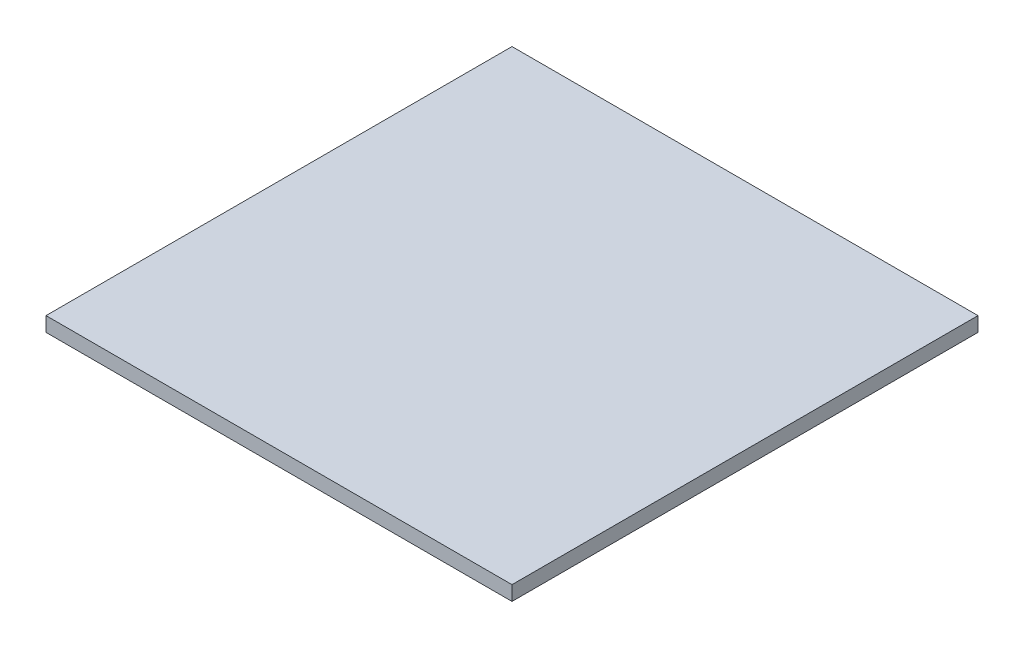
ISO-10303-21;
HEADER;
FILE_DESCRIPTION(('STEP AP214'),'2;1');
FILE_NAME('part.step','',(''),(''),'','','');
FILE_SCHEMA(('AUTOMOTIVE_DESIGN { 1 0 10303 214 1 1 1 1 }'));
ENDSEC;
DATA;
#1=APPLICATION_CONTEXT('core data for automotive mechanical design processes');
#2=APPLICATION_PROTOCOL_DEFINITION('international standard','automotive_design',2000,#1);
#3=PRODUCT_CONTEXT('',#1,'mechanical');
#4=PRODUCT('Part','Part','',(#3));
#5=PRODUCT_RELATED_PRODUCT_CATEGORY('part','',(#4));
#6=PRODUCT_DEFINITION_FORMATION('','',#4);
#7=PRODUCT_DEFINITION_CONTEXT('part definition',#1,'design');
#8=PRODUCT_DEFINITION('design','',#6,#7);
#9=PRODUCT_DEFINITION_SHAPE('','',#8);
#10=(LENGTH_UNIT() NAMED_UNIT(*) SI_UNIT(.MILLI.,.METRE.));
#11=(NAMED_UNIT(*) PLANE_ANGLE_UNIT() SI_UNIT($,.RADIAN.));
#12=(NAMED_UNIT(*) SI_UNIT($,.STERADIAN.) SOLID_ANGLE_UNIT());
#13=UNCERTAINTY_MEASURE_WITH_UNIT(LENGTH_MEASURE(1.E-05),#10,'distance_accuracy_value','');
#14=(GEOMETRIC_REPRESENTATION_CONTEXT(3) GLOBAL_UNCERTAINTY_ASSIGNED_CONTEXT((#13)) GLOBAL_UNIT_ASSIGNED_CONTEXT((#10,
#11,#12)) REPRESENTATION_CONTEXT('',''));
#15=CARTESIAN_POINT('',(0.,0.,0.));
#16=DIRECTION('',(0.,0.,1.));
#17=DIRECTION('',(1.,0.,0.));
#18=AXIS2_PLACEMENT_3D('',#15,#16,#17);
#19=CARTESIAN_POINT('',(0.,6.35,0.));
#20=DIRECTION('',(1.,0.,0.));
#21=DIRECTION('',(0.,0.,-1.));
#22=AXIS2_PLACEMENT_3D('',#19,#20,#21);
#23=PLANE('',#22);
#24=DIRECTION('',(0.,0.,1.));
#25=VECTOR('',#24,1.);
#26=CARTESIAN_POINT('',(0.,0.,0.));
#27=LINE('',#26,#25);
#28=CARTESIAN_POINT('',(0.,0.,-203.2));
#29=VERTEX_POINT('',#28);
#30=CARTESIAN_POINT('',(0.,0.,0.));
#31=VERTEX_POINT('',#30);
#32=EDGE_CURVE('E97',#29,#31,#27,.T.);
#33=ORIENTED_EDGE('',*,*,#32,.T.);
#34=DIRECTION('',(0.,-1.,0.));
#35=VECTOR('',#34,1.);
#36=CARTESIAN_POINT('',(0.,6.35,0.));
#37=LINE('',#36,#35);
#38=CARTESIAN_POINT('',(0.,6.35,0.));
#39=VERTEX_POINT('',#38);
#40=EDGE_CURVE('E11',#39,#31,#37,.T.);
#41=ORIENTED_EDGE('',*,*,#40,.F.);
#42=DIRECTION('',(0.,0.,1.));
#43=VECTOR('',#42,1.);
#44=CARTESIAN_POINT('',(0.,6.35,0.));
#45=LINE('',#44,#43);
#46=CARTESIAN_POINT('',(0.,6.35,-203.2));
#47=VERTEX_POINT('',#46);
#48=EDGE_CURVE('E85',#47,#39,#45,.T.);
#49=ORIENTED_EDGE('',*,*,#48,.F.);
#50=DIRECTION('',(0.,-1.,0.));
#51=VECTOR('',#50,1.);
#52=CARTESIAN_POINT('',(0.,6.35,-203.2));
#53=LINE('',#52,#51);
#54=EDGE_CURVE('E93',#47,#29,#53,.T.);
#55=ORIENTED_EDGE('',*,*,#54,.T.);
#56=EDGE_LOOP('',(#33,#41,#49,#55));
#57=FACE_BOUND('',#56,.T.);
#58=ADVANCED_FACE('F34',(#57),#23,.F.);
#59=CARTESIAN_POINT('',(0.,6.35,0.));
#60=DIRECTION('',(0.,0.,-1.));
#61=DIRECTION('',(-1.,0.,0.));
#62=AXIS2_PLACEMENT_3D('',#59,#60,#61);
#63=PLANE('',#62);
#64=DIRECTION('',(1.,0.,0.));
#65=VECTOR('',#64,1.);
#66=CARTESIAN_POINT('',(0.,0.,0.));
#67=LINE('',#66,#65);
#68=CARTESIAN_POINT('',(203.2,0.,0.));
#69=VERTEX_POINT('',#68);
#70=EDGE_CURVE('E89',#31,#69,#67,.T.);
#71=ORIENTED_EDGE('',*,*,#70,.T.);
#72=DIRECTION('',(0.,-1.,0.));
#73=VECTOR('',#72,1.);
#74=CARTESIAN_POINT('',(203.2,6.35,0.));
#75=LINE('',#74,#73);
#76=CARTESIAN_POINT('',(203.2,6.35,0.));
#77=VERTEX_POINT('',#76);
#78=EDGE_CURVE('E42',#77,#69,#75,.T.);
#79=ORIENTED_EDGE('',*,*,#78,.F.);
#80=DIRECTION('',(1.,0.,0.));
#81=VECTOR('',#80,1.);
#82=CARTESIAN_POINT('',(0.,6.35,0.));
#83=LINE('',#82,#81);
#84=EDGE_CURVE('E80',#39,#77,#83,.T.);
#85=ORIENTED_EDGE('',*,*,#84,.F.);
#86=ORIENTED_EDGE('',*,*,#40,.T.);
#87=EDGE_LOOP('',(#71,#79,#85,#86));
#88=FACE_BOUND('',#87,.T.);
#89=ADVANCED_FACE('F88',(#88),#63,.F.);
#90=CARTESIAN_POINT('',(203.2,6.35,0.));
#91=DIRECTION('',(-1.,0.,0.));
#92=DIRECTION('',(0.,0.,1.));
#93=AXIS2_PLACEMENT_3D('',#90,#91,#92);
#94=PLANE('',#93);
#95=DIRECTION('',(0.,0.,-1.));
#96=VECTOR('',#95,1.);
#97=CARTESIAN_POINT('',(203.2,0.,0.));
#98=LINE('',#97,#96);
#99=CARTESIAN_POINT('',(203.2,0.,-203.2));
#100=VERTEX_POINT('',#99);
#101=EDGE_CURVE('E67',#69,#100,#98,.T.);
#102=ORIENTED_EDGE('',*,*,#101,.T.);
#103=DIRECTION('',(0.,-1.,0.));
#104=VECTOR('',#103,1.);
#105=CARTESIAN_POINT('',(203.2,6.35,-203.2));
#106=LINE('',#105,#104);
#107=CARTESIAN_POINT('',(203.2,6.35,-203.2));
#108=VERTEX_POINT('',#107);
#109=EDGE_CURVE('E90',#108,#100,#106,.T.);
#110=ORIENTED_EDGE('',*,*,#109,.F.);
#111=DIRECTION('',(0.,0.,-1.));
#112=VECTOR('',#111,1.);
#113=CARTESIAN_POINT('',(203.2,6.35,0.));
#114=LINE('',#113,#112);
#115=EDGE_CURVE('E83',#77,#108,#114,.T.);
#116=ORIENTED_EDGE('',*,*,#115,.F.);
#117=ORIENTED_EDGE('',*,*,#78,.T.);
#118=EDGE_LOOP('',(#102,#110,#116,#117));
#119=FACE_BOUND('',#118,.T.);
#120=ADVANCED_FACE('F91',(#119),#94,.F.);
#121=CARTESIAN_POINT('',(0.,6.35,-203.2));
#122=DIRECTION('',(0.,0.,1.));
#123=DIRECTION('',(1.,0.,0.));
#124=AXIS2_PLACEMENT_3D('',#121,#122,#123);
#125=PLANE('',#124);
#126=DIRECTION('',(-1.,0.,0.));
#127=VECTOR('',#126,1.);
#128=CARTESIAN_POINT('',(0.,0.,-203.2));
#129=LINE('',#128,#127);
#130=EDGE_CURVE('E73',#100,#29,#129,.T.);
#131=ORIENTED_EDGE('',*,*,#130,.T.);
#132=ORIENTED_EDGE('',*,*,#54,.F.);
#133=DIRECTION('',(-1.,0.,0.));
#134=VECTOR('',#133,1.);
#135=CARTESIAN_POINT('',(0.,6.35,-203.2));
#136=LINE('',#135,#134);
#137=EDGE_CURVE('E50',#108,#47,#136,.T.);
#138=ORIENTED_EDGE('',*,*,#137,.F.);
#139=ORIENTED_EDGE('',*,*,#109,.T.);
#140=EDGE_LOOP('',(#131,#132,#138,#139));
#141=FACE_BOUND('',#140,.T.);
#142=ADVANCED_FACE('F104',(#141),#125,.F.);
#143=CARTESIAN_POINT('',(0.,6.35,-203.2));
#144=DIRECTION('',(0.,-1.,0.));
#145=DIRECTION('',(0.,0.,-1.));
#146=AXIS2_PLACEMENT_3D('',#143,#144,#145);
#147=PLANE('',#146);
#148=ORIENTED_EDGE('',*,*,#48,.T.);
#149=ORIENTED_EDGE('',*,*,#84,.T.);
#150=ORIENTED_EDGE('',*,*,#115,.T.);
#151=ORIENTED_EDGE('',*,*,#137,.T.);
#152=EDGE_LOOP('',(#148,#149,#150,#151));
#153=FACE_BOUND('',#152,.T.);
#154=ADVANCED_FACE('F81',(#153),#147,.F.);
#155=CARTESIAN_POINT('',(0.,0.,-203.2));
#156=DIRECTION('',(0.,-1.,0.));
#157=DIRECTION('',(0.,0.,-1.));
#158=AXIS2_PLACEMENT_3D('',#155,#156,#157);
#159=PLANE('',#158);
#160=ORIENTED_EDGE('',*,*,#32,.F.);
#161=ORIENTED_EDGE('',*,*,#130,.F.);
#162=ORIENTED_EDGE('',*,*,#101,.F.);
#163=ORIENTED_EDGE('',*,*,#70,.F.);
#164=EDGE_LOOP('',(#160,#161,#162,#163));
#165=FACE_BOUND('',#164,.T.);
#166=ADVANCED_FACE('F107',(#165),#159,.T.);
#167=CLOSED_SHELL('',(#58,#89,#120,#142,#154,#166));
#168=MANIFOLD_SOLID_BREP('B2',#167);
#169=ADVANCED_BREP_SHAPE_REPRESENTATION('',(#18,#168),#14);
#170=SHAPE_DEFINITION_REPRESENTATION(#9,#169);
ENDSEC;
END-ISO-10303-21;
